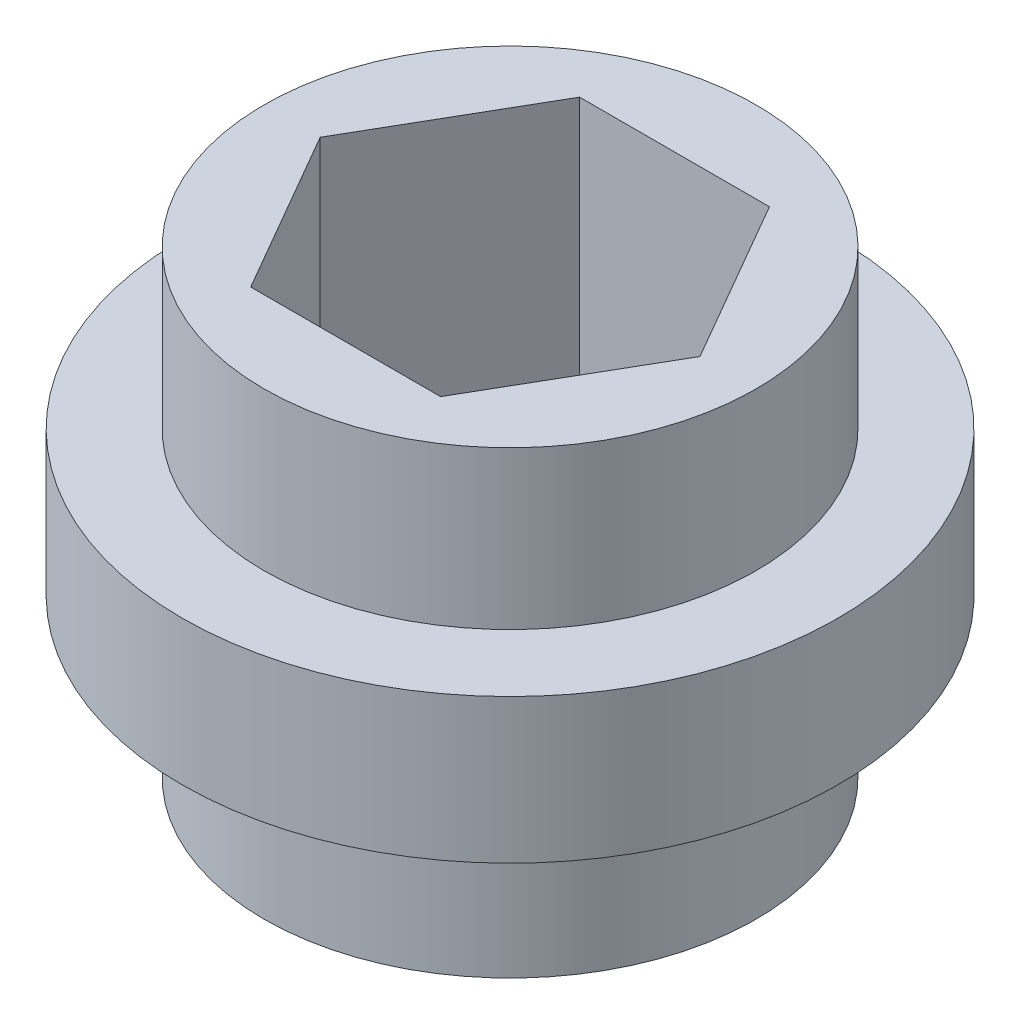
ISO-10303-21;
HEADER;
FILE_DESCRIPTION(('STEP AP214'),'2;1');
FILE_NAME('part.step','',(''),(''),'','','');
FILE_SCHEMA(('AUTOMOTIVE_DESIGN { 1 0 10303 214 1 1 1 1 }'));
ENDSEC;
DATA;
#1=APPLICATION_CONTEXT('core data for automotive mechanical design processes');
#2=APPLICATION_PROTOCOL_DEFINITION('international standard','automotive_design',2000,#1);
#3=PRODUCT_CONTEXT('',#1,'mechanical');
#4=PRODUCT('Part','Part','',(#3));
#5=PRODUCT_RELATED_PRODUCT_CATEGORY('part','',(#4));
#6=PRODUCT_DEFINITION_FORMATION('','',#4);
#7=PRODUCT_DEFINITION_CONTEXT('part definition',#1,'design');
#8=PRODUCT_DEFINITION('design','',#6,#7);
#9=PRODUCT_DEFINITION_SHAPE('','',#8);
#10=(LENGTH_UNIT() NAMED_UNIT(*) SI_UNIT(.MILLI.,.METRE.));
#11=(NAMED_UNIT(*) PLANE_ANGLE_UNIT() SI_UNIT($,.RADIAN.));
#12=(NAMED_UNIT(*) SI_UNIT($,.STERADIAN.) SOLID_ANGLE_UNIT());
#13=UNCERTAINTY_MEASURE_WITH_UNIT(LENGTH_MEASURE(1.E-05),#10,'distance_accuracy_value','');
#14=(GEOMETRIC_REPRESENTATION_CONTEXT(3) GLOBAL_UNCERTAINTY_ASSIGNED_CONTEXT((#13)) GLOBAL_UNIT_ASSIGNED_CONTEXT((#10,
#11,#12)) REPRESENTATION_CONTEXT('',''));
#15=CARTESIAN_POINT('',(0.,0.,0.));
#16=DIRECTION('',(0.,0.,1.));
#17=DIRECTION('',(1.,0.,0.));
#18=AXIS2_PLACEMENT_3D('',#15,#16,#17);
#19=CARTESIAN_POINT('',(0.,-7.,0.));
#20=DIRECTION('',(0.,1.,0.));
#21=DIRECTION('',(0.,0.,1.));
#22=AXIS2_PLACEMENT_3D('',#19,#20,#21);
#23=CYLINDRICAL_SURFACE('',#22,7.5);
#24=CARTESIAN_POINT('',(0.,-7.,0.));
#25=DIRECTION('',(0.,1.,0.));
#26=DIRECTION('',(0.,0.,1.));
#27=AXIS2_PLACEMENT_3D('',#24,#25,#26);
#28=CIRCLE('',#27,7.5);
#29=CARTESIAN_POINT('',(0.,-7.,7.5));
#30=VERTEX_POINT('',#29);
#31=EDGE_CURVE('E123',#30,#30,#28,.T.);
#32=ORIENTED_EDGE('',*,*,#31,.T.);
#33=EDGE_LOOP('',(#32));
#34=FACE_BOUND('',#33,.T.);
#35=CARTESIAN_POINT('',(0.,-2.2,0.));
#36=DIRECTION('',(0.,1.,0.));
#37=DIRECTION('',(0.,0.,1.));
#38=AXIS2_PLACEMENT_3D('',#35,#36,#37);
#39=CIRCLE('',#38,7.5);
#40=CARTESIAN_POINT('',(0.,-2.2,7.5));
#41=VERTEX_POINT('',#40);
#42=EDGE_CURVE('E131',#41,#41,#39,.F.);
#43=ORIENTED_EDGE('',*,*,#42,.T.);
#44=EDGE_LOOP('',(#43));
#45=FACE_BOUND('',#44,.T.);
#46=ADVANCED_FACE('F41',(#34,#45),#23,.T.);
#47=CARTESIAN_POINT('',(-4.34095233646949,-7.,2.50624999999998));
#48=DIRECTION('',(-0.86602540378444,0.,0.499999999999998));
#49=DIRECTION('',(0.499999999999998,0.,0.86602540378444));
#50=AXIS2_PLACEMENT_3D('',#47,#48,#49);
#51=PLANE('',#50);
#52=DIRECTION('',(0.499999999999998,0.,0.86602540378444));
#53=VECTOR('',#52,1.);
#54=CARTESIAN_POINT('',(-4.34095233646949,7.,2.50624999999998));
#55=LINE('',#54,#53);
#56=CARTESIAN_POINT('',(-5.78793644862597,7.,0.));
#57=VERTEX_POINT('',#56);
#58=CARTESIAN_POINT('',(-2.89396822431298,7.,5.0125));
#59=VERTEX_POINT('',#58);
#60=EDGE_CURVE('E127',#57,#59,#55,.T.);
#61=ORIENTED_EDGE('',*,*,#60,.T.);
#62=DIRECTION('',(0.,1.,0.));
#63=VECTOR('',#62,1.);
#64=CARTESIAN_POINT('',(-2.89396822431298,-7.,5.0125));
#65=LINE('',#64,#63);
#66=CARTESIAN_POINT('',(-2.89396822431298,-7.,5.0125));
#67=VERTEX_POINT('',#66);
#68=EDGE_CURVE('E50',#67,#59,#65,.T.);
#69=ORIENTED_EDGE('',*,*,#68,.F.);
#70=DIRECTION('',(0.499999999999998,0.,0.86602540378444));
#71=VECTOR('',#70,1.);
#72=CARTESIAN_POINT('',(-4.34095233646949,-7.,2.50624999999998));
#73=LINE('',#72,#71);
#74=CARTESIAN_POINT('',(-5.78793644862597,-7.,0.));
#75=VERTEX_POINT('',#74);
#76=EDGE_CURVE('E145',#75,#67,#73,.T.);
#77=ORIENTED_EDGE('',*,*,#76,.F.);
#78=DIRECTION('',(0.,1.,0.));
#79=VECTOR('',#78,1.);
#80=CARTESIAN_POINT('',(-5.78793644862597,-7.,0.));
#81=LINE('',#80,#79);
#82=EDGE_CURVE('E126',#75,#57,#81,.T.);
#83=ORIENTED_EDGE('',*,*,#82,.T.);
#84=EDGE_LOOP('',(#61,#69,#77,#83));
#85=FACE_BOUND('',#84,.T.);
#86=ADVANCED_FACE('F43',(#85),#51,.F.);
#87=CARTESIAN_POINT('',(0.,-7.,5.0125));
#88=DIRECTION('',(0.,0.,1.));
#89=DIRECTION('',(1.,0.,0.));
#90=AXIS2_PLACEMENT_3D('',#87,#88,#89);
#91=PLANE('',#90);
#92=DIRECTION('',(1.,0.,0.));
#93=VECTOR('',#92,1.);
#94=CARTESIAN_POINT('',(0.,7.,5.0125));
#95=LINE('',#94,#93);
#96=CARTESIAN_POINT('',(2.89396822431301,7.,5.0125));
#97=VERTEX_POINT('',#96);
#98=EDGE_CURVE('E140',#59,#97,#95,.T.);
#99=ORIENTED_EDGE('',*,*,#98,.T.);
#100=DIRECTION('',(0.,1.,0.));
#101=VECTOR('',#100,1.);
#102=CARTESIAN_POINT('',(2.89396822431301,-7.,5.0125));
#103=LINE('',#102,#101);
#104=CARTESIAN_POINT('',(2.89396822431301,-7.,5.0125));
#105=VERTEX_POINT('',#104);
#106=EDGE_CURVE('E80',#105,#97,#103,.T.);
#107=ORIENTED_EDGE('',*,*,#106,.F.);
#108=DIRECTION('',(1.,0.,0.));
#109=VECTOR('',#108,1.);
#110=CARTESIAN_POINT('',(0.,-7.,5.0125));
#111=LINE('',#110,#109);
#112=EDGE_CURVE('E58',#67,#105,#111,.T.);
#113=ORIENTED_EDGE('',*,*,#112,.F.);
#114=ORIENTED_EDGE('',*,*,#68,.T.);
#115=EDGE_LOOP('',(#99,#107,#113,#114));
#116=FACE_BOUND('',#115,.T.);
#117=ADVANCED_FACE('F171',(#116),#91,.F.);
#118=CARTESIAN_POINT('',(4.3409523364695,-7.,2.50624999999997));
#119=DIRECTION('',(0.866025403784441,0.,0.499999999999995));
#120=DIRECTION('',(0.499999999999995,0.,-0.866025403784441));
#121=AXIS2_PLACEMENT_3D('',#118,#119,#120);
#122=PLANE('',#121);
#123=DIRECTION('',(0.499999999999995,0.,-0.866025403784441));
#124=VECTOR('',#123,1.);
#125=CARTESIAN_POINT('',(4.3409523364695,7.,2.50624999999997));
#126=LINE('',#125,#124);
#127=CARTESIAN_POINT('',(5.78793644862597,7.,0.));
#128=VERTEX_POINT('',#127);
#129=EDGE_CURVE('E109',#97,#128,#126,.T.);
#130=ORIENTED_EDGE('',*,*,#129,.T.);
#131=DIRECTION('',(0.,1.,0.));
#132=VECTOR('',#131,1.);
#133=CARTESIAN_POINT('',(5.78793644862597,-7.,0.));
#134=LINE('',#133,#132);
#135=CARTESIAN_POINT('',(5.78793644862597,-7.,0.));
#136=VERTEX_POINT('',#135);
#137=EDGE_CURVE('E106',#136,#128,#134,.T.);
#138=ORIENTED_EDGE('',*,*,#137,.F.);
#139=DIRECTION('',(0.499999999999995,0.,-0.866025403784441));
#140=VECTOR('',#139,1.);
#141=CARTESIAN_POINT('',(4.3409523364695,-7.,2.50624999999997));
#142=LINE('',#141,#140);
#143=EDGE_CURVE('E98',#105,#136,#142,.T.);
#144=ORIENTED_EDGE('',*,*,#143,.F.);
#145=ORIENTED_EDGE('',*,*,#106,.T.);
#146=EDGE_LOOP('',(#130,#138,#144,#145));
#147=FACE_BOUND('',#146,.T.);
#148=ADVANCED_FACE('F107',(#147),#122,.F.);
#149=CARTESIAN_POINT('',(4.34095233646949,-7.,-2.50624999999998));
#150=DIRECTION('',(0.86602540378444,0.,-0.499999999999998));
#151=DIRECTION('',(-0.499999999999998,0.,-0.86602540378444));
#152=AXIS2_PLACEMENT_3D('',#149,#150,#151);
#153=PLANE('',#152);
#154=DIRECTION('',(-0.499999999999998,0.,-0.86602540378444));
#155=VECTOR('',#154,1.);
#156=CARTESIAN_POINT('',(4.34095233646949,7.,-2.50624999999998));
#157=LINE('',#156,#155);
#158=CARTESIAN_POINT('',(2.89396822431298,7.,-5.0125));
#159=VERTEX_POINT('',#158);
#160=EDGE_CURVE('E137',#128,#159,#157,.T.);
#161=ORIENTED_EDGE('',*,*,#160,.T.);
#162=DIRECTION('',(0.,1.,0.));
#163=VECTOR('',#162,1.);
#164=CARTESIAN_POINT('',(2.89396822431298,-7.,-5.0125));
#165=LINE('',#164,#163);
#166=CARTESIAN_POINT('',(2.89396822431298,-7.,-5.0125));
#167=VERTEX_POINT('',#166);
#168=EDGE_CURVE('E113',#167,#159,#165,.T.);
#169=ORIENTED_EDGE('',*,*,#168,.F.);
#170=DIRECTION('',(-0.499999999999998,0.,-0.86602540378444));
#171=VECTOR('',#170,1.);
#172=CARTESIAN_POINT('',(4.34095233646949,-7.,-2.50624999999998));
#173=LINE('',#172,#171);
#174=EDGE_CURVE('E103',#136,#167,#173,.T.);
#175=ORIENTED_EDGE('',*,*,#174,.F.);
#176=ORIENTED_EDGE('',*,*,#137,.T.);
#177=EDGE_LOOP('',(#161,#169,#175,#176));
#178=FACE_BOUND('',#177,.T.);
#179=ADVANCED_FACE('F115',(#178),#153,.F.);
#180=CARTESIAN_POINT('',(0.,-7.,-5.0125));
#181=DIRECTION('',(0.,0.,-1.));
#182=DIRECTION('',(-1.,0.,0.));
#183=AXIS2_PLACEMENT_3D('',#180,#181,#182);
#184=PLANE('',#183);
#185=DIRECTION('',(-1.,0.,0.));
#186=VECTOR('',#185,1.);
#187=CARTESIAN_POINT('',(0.,7.,-5.0125));
#188=LINE('',#187,#186);
#189=CARTESIAN_POINT('',(-2.89396822431299,7.,-5.0125));
#190=VERTEX_POINT('',#189);
#191=EDGE_CURVE('E134',#159,#190,#188,.T.);
#192=ORIENTED_EDGE('',*,*,#191,.T.);
#193=DIRECTION('',(0.,1.,0.));
#194=VECTOR('',#193,1.);
#195=CARTESIAN_POINT('',(-2.89396822431299,-7.,-5.0125));
#196=LINE('',#195,#194);
#197=CARTESIAN_POINT('',(-2.89396822431299,-7.,-5.0125));
#198=VERTEX_POINT('',#197);
#199=EDGE_CURVE('E149',#198,#190,#196,.T.);
#200=ORIENTED_EDGE('',*,*,#199,.F.);
#201=DIRECTION('',(-1.,0.,0.));
#202=VECTOR('',#201,1.);
#203=CARTESIAN_POINT('',(0.,-7.,-5.0125));
#204=LINE('',#203,#202);
#205=EDGE_CURVE('E117',#167,#198,#204,.T.);
#206=ORIENTED_EDGE('',*,*,#205,.F.);
#207=ORIENTED_EDGE('',*,*,#168,.T.);
#208=EDGE_LOOP('',(#192,#200,#206,#207));
#209=FACE_BOUND('',#208,.T.);
#210=ADVANCED_FACE('F196',(#209),#184,.F.);
#211=CARTESIAN_POINT('',(-4.34095233646949,-7.,-2.50624999999998));
#212=DIRECTION('',(-0.86602540378444,0.,-0.499999999999998));
#213=DIRECTION('',(-0.499999999999998,0.,0.86602540378444));
#214=AXIS2_PLACEMENT_3D('',#211,#212,#213);
#215=PLANE('',#214);
#216=DIRECTION('',(-0.499999999999998,0.,0.86602540378444));
#217=VECTOR('',#216,1.);
#218=CARTESIAN_POINT('',(-4.34095233646949,7.,-2.50624999999998));
#219=LINE('',#218,#217);
#220=EDGE_CURVE('E130',#190,#57,#219,.T.);
#221=ORIENTED_EDGE('',*,*,#220,.T.);
#222=ORIENTED_EDGE('',*,*,#82,.F.);
#223=DIRECTION('',(-0.499999999999998,0.,0.86602540378444));
#224=VECTOR('',#223,1.);
#225=CARTESIAN_POINT('',(-4.34095233646949,-7.,-2.50624999999998));
#226=LINE('',#225,#224);
#227=EDGE_CURVE('E91',#198,#75,#226,.T.);
#228=ORIENTED_EDGE('',*,*,#227,.F.);
#229=ORIENTED_EDGE('',*,*,#199,.T.);
#230=EDGE_LOOP('',(#221,#222,#228,#229));
#231=FACE_BOUND('',#230,.T.);
#232=ADVANCED_FACE('F188',(#231),#215,.F.);
#233=CARTESIAN_POINT('',(0.,2.2,0.));
#234=DIRECTION('',(0.,1.,0.));
#235=DIRECTION('',(0.,0.,1.));
#236=AXIS2_PLACEMENT_3D('',#233,#234,#235);
#237=CIRCLE('',#236,7.5);
#238=CARTESIAN_POINT('',(0.,2.2,7.5));
#239=VERTEX_POINT('',#238);
#240=EDGE_CURVE('E11',#239,#239,#237,.F.);
#241=ORIENTED_EDGE('',*,*,#240,.F.);
#242=EDGE_LOOP('',(#241));
#243=FACE_BOUND('',#242,.T.);
#244=CARTESIAN_POINT('',(0.,7.,0.));
#245=DIRECTION('',(0.,1.,0.));
#246=DIRECTION('',(0.,0.,1.));
#247=AXIS2_PLACEMENT_3D('',#244,#245,#246);
#248=CIRCLE('',#247,7.5);
#249=CARTESIAN_POINT('',(0.,7.,7.5));
#250=VERTEX_POINT('',#249);
#251=EDGE_CURVE('E142',#250,#250,#248,.T.);
#252=ORIENTED_EDGE('',*,*,#251,.F.);
#253=EDGE_LOOP('',(#252));
#254=FACE_BOUND('',#253,.T.);
#255=ADVANCED_FACE('F182',(#243,#254),#23,.T.);
#256=CARTESIAN_POINT('',(0.,-7.,0.));
#257=DIRECTION('',(0.,1.,0.));
#258=DIRECTION('',(0.,0.,1.));
#259=AXIS2_PLACEMENT_3D('',#256,#257,#258);
#260=PLANE('',#259);
#261=ORIENTED_EDGE('',*,*,#76,.T.);
#262=ORIENTED_EDGE('',*,*,#112,.T.);
#263=ORIENTED_EDGE('',*,*,#143,.T.);
#264=ORIENTED_EDGE('',*,*,#174,.T.);
#265=ORIENTED_EDGE('',*,*,#205,.T.);
#266=ORIENTED_EDGE('',*,*,#227,.T.);
#267=EDGE_LOOP('',(#261,#262,#263,#264,#265,#266));
#268=FACE_BOUND('',#267,.T.);
#269=ORIENTED_EDGE('',*,*,#31,.F.);
#270=EDGE_LOOP('',(#269));
#271=FACE_BOUND('',#270,.T.);
#272=ADVANCED_FACE('F100',(#268,#271),#260,.F.);
#273=CARTESIAN_POINT('',(0.,7.,0.));
#274=DIRECTION('',(0.,1.,0.));
#275=DIRECTION('',(0.,0.,1.));
#276=AXIS2_PLACEMENT_3D('',#273,#274,#275);
#277=PLANE('',#276);
#278=ORIENTED_EDGE('',*,*,#60,.F.);
#279=ORIENTED_EDGE('',*,*,#220,.F.);
#280=ORIENTED_EDGE('',*,*,#191,.F.);
#281=ORIENTED_EDGE('',*,*,#160,.F.);
#282=ORIENTED_EDGE('',*,*,#129,.F.);
#283=ORIENTED_EDGE('',*,*,#98,.F.);
#284=EDGE_LOOP('',(#278,#279,#280,#281,#282,#283));
#285=FACE_BOUND('',#284,.T.);
#286=ORIENTED_EDGE('',*,*,#251,.T.);
#287=EDGE_LOOP('',(#286));
#288=FACE_BOUND('',#287,.T.);
#289=ADVANCED_FACE('F168',(#285,#288),#277,.T.);
#290=CARTESIAN_POINT('',(0.,2.2,0.));
#291=DIRECTION('',(0.,-1.,0.));
#292=DIRECTION('',(0.,0.,-1.));
#293=AXIS2_PLACEMENT_3D('',#290,#291,#292);
#294=CYLINDRICAL_SURFACE('',#293,10.);
#295=CARTESIAN_POINT('',(0.,2.2,0.));
#296=DIRECTION('',(0.,1.,0.));
#297=DIRECTION('',(0.,0.,1.));
#298=AXIS2_PLACEMENT_3D('',#295,#296,#297);
#299=CIRCLE('',#298,10.);
#300=CARTESIAN_POINT('',(0.,2.2,10.));
#301=VERTEX_POINT('',#300);
#302=EDGE_CURVE('E152',#301,#301,#299,.T.);
#303=ORIENTED_EDGE('',*,*,#302,.F.);
#304=EDGE_LOOP('',(#303));
#305=FACE_BOUND('',#304,.T.);
#306=CARTESIAN_POINT('',(0.,-2.2,0.));
#307=DIRECTION('',(0.,1.,0.));
#308=DIRECTION('',(0.,0.,1.));
#309=AXIS2_PLACEMENT_3D('',#306,#307,#308);
#310=CIRCLE('',#309,10.);
#311=CARTESIAN_POINT('',(0.,-2.2,10.));
#312=VERTEX_POINT('',#311);
#313=EDGE_CURVE('E156',#312,#312,#310,.T.);
#314=ORIENTED_EDGE('',*,*,#313,.T.);
#315=EDGE_LOOP('',(#314));
#316=FACE_BOUND('',#315,.T.);
#317=ADVANCED_FACE('F201',(#305,#316),#294,.T.);
#318=CARTESIAN_POINT('',(0.,2.2,0.));
#319=DIRECTION('',(0.,1.,0.));
#320=DIRECTION('',(0.,0.,1.));
#321=AXIS2_PLACEMENT_3D('',#318,#319,#320);
#322=PLANE('',#321);
#323=ORIENTED_EDGE('',*,*,#240,.T.);
#324=EDGE_LOOP('',(#323));
#325=FACE_BOUND('',#324,.T.);
#326=ORIENTED_EDGE('',*,*,#302,.T.);
#327=EDGE_LOOP('',(#326));
#328=FACE_BOUND('',#327,.T.);
#329=ADVANCED_FACE('F204',(#325,#328),#322,.T.);
#330=CARTESIAN_POINT('',(0.,-2.2,0.));
#331=DIRECTION('',(0.,1.,0.));
#332=DIRECTION('',(0.,0.,1.));
#333=AXIS2_PLACEMENT_3D('',#330,#331,#332);
#334=PLANE('',#333);
#335=ORIENTED_EDGE('',*,*,#42,.F.);
#336=EDGE_LOOP('',(#335));
#337=FACE_BOUND('',#336,.T.);
#338=ORIENTED_EDGE('',*,*,#313,.F.);
#339=EDGE_LOOP('',(#338));
#340=FACE_BOUND('',#339,.T.);
#341=ADVANCED_FACE('F208',(#337,#340),#334,.F.);
#342=CLOSED_SHELL('',(#46,#86,#117,#148,#179,#210,#232,#255,#272,#289,#317,#329,#341));
#343=MANIFOLD_SOLID_BREP('B2',#342);
#344=ADVANCED_BREP_SHAPE_REPRESENTATION('',(#18,#343),#14);
#345=SHAPE_DEFINITION_REPRESENTATION(#9,#344);
ENDSEC;
END-ISO-10303-21;
